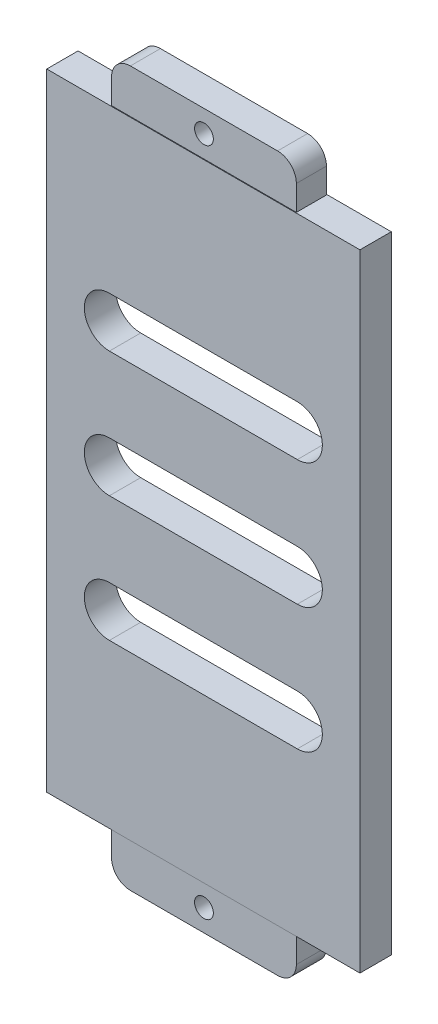
ISO-10303-21;
HEADER;
FILE_DESCRIPTION(('STEP AP214'),'2;1');
FILE_NAME('part.step','',(''),(''),'','','');
FILE_SCHEMA(('AUTOMOTIVE_DESIGN { 1 0 10303 214 1 1 1 1 }'));
ENDSEC;
DATA;
#1=APPLICATION_CONTEXT('core data for automotive mechanical design processes');
#2=APPLICATION_PROTOCOL_DEFINITION('international standard','automotive_design',2000,#1);
#3=PRODUCT_CONTEXT('',#1,'mechanical');
#4=PRODUCT('Part','Part','',(#3));
#5=PRODUCT_RELATED_PRODUCT_CATEGORY('part','',(#4));
#6=PRODUCT_DEFINITION_FORMATION('','',#4);
#7=PRODUCT_DEFINITION_CONTEXT('part definition',#1,'design');
#8=PRODUCT_DEFINITION('design','',#6,#7);
#9=PRODUCT_DEFINITION_SHAPE('','',#8);
#10=(LENGTH_UNIT() NAMED_UNIT(*) SI_UNIT(.MILLI.,.METRE.));
#11=(NAMED_UNIT(*) PLANE_ANGLE_UNIT() SI_UNIT($,.RADIAN.));
#12=(NAMED_UNIT(*) SI_UNIT($,.STERADIAN.) SOLID_ANGLE_UNIT());
#13=UNCERTAINTY_MEASURE_WITH_UNIT(LENGTH_MEASURE(1.E-05),#10,'distance_accuracy_value','');
#14=(GEOMETRIC_REPRESENTATION_CONTEXT(3) GLOBAL_UNCERTAINTY_ASSIGNED_CONTEXT((#13)) GLOBAL_UNIT_ASSIGNED_CONTEXT((#10,
#11,#12)) REPRESENTATION_CONTEXT('',''));
#15=CARTESIAN_POINT('',(0.,0.,0.));
#16=DIRECTION('',(0.,0.,1.));
#17=DIRECTION('',(1.,0.,0.));
#18=AXIS2_PLACEMENT_3D('',#15,#16,#17);
#19=CARTESIAN_POINT('',(-25.,-50.,-5.));
#20=DIRECTION('',(0.,-1.,0.));
#21=DIRECTION('',(0.,0.,-1.));
#22=AXIS2_PLACEMENT_3D('',#19,#20,#21);
#23=PLANE('',#22);
#24=DIRECTION('',(1.,0.,0.));
#25=VECTOR('',#24,1.);
#26=CARTESIAN_POINT('',(-25.,-50.,0.));
#27=LINE('',#26,#25);
#28=CARTESIAN_POINT('',(-25.,-50.,0.));
#29=VERTEX_POINT('',#28);
#30=CARTESIAN_POINT('',(25.,-50.,0.));
#31=VERTEX_POINT('',#30);
#32=EDGE_CURVE('E397',#29,#31,#27,.T.);
#33=ORIENTED_EDGE('',*,*,#32,.F.);
#34=DIRECTION('',(0.,0.,1.));
#35=VECTOR('',#34,1.);
#36=CARTESIAN_POINT('',(-25.,-50.,-5.));
#37=LINE('',#36,#35);
#38=CARTESIAN_POINT('',(-25.,-50.,-5.));
#39=VERTEX_POINT('',#38);
#40=EDGE_CURVE('E420',#39,#29,#37,.T.);
#41=ORIENTED_EDGE('',*,*,#40,.F.);
#42=DIRECTION('',(1.,0.,0.));
#43=VECTOR('',#42,1.);
#44=CARTESIAN_POINT('',(-25.,-50.,-5.));
#45=LINE('',#44,#43);
#46=CARTESIAN_POINT('',(25.,-50.,-5.));
#47=VERTEX_POINT('',#46);
#48=EDGE_CURVE('E403',#39,#47,#45,.T.);
#49=ORIENTED_EDGE('',*,*,#48,.T.);
#50=DIRECTION('',(0.,0.,1.));
#51=VECTOR('',#50,1.);
#52=CARTESIAN_POINT('',(25.,-50.,-5.));
#53=LINE('',#52,#51);
#54=EDGE_CURVE('E417',#47,#31,#53,.T.);
#55=ORIENTED_EDGE('',*,*,#54,.T.);
#56=EDGE_LOOP('',(#33,#41,#49,#55));
#57=FACE_BOUND('',#56,.T.);
#58=DIRECTION('',(1.,0.,0.));
#59=VECTOR('',#58,1.);
#60=CARTESIAN_POINT('',(0.,-50.,-0.100000000000001));
#61=LINE('',#60,#59);
#62=CARTESIAN_POINT('',(-14.75,-50.,-0.100000000000001));
#63=VERTEX_POINT('',#62);
#64=CARTESIAN_POINT('',(14.75,-50.,-0.100000000000001));
#65=VERTEX_POINT('',#64);
#66=EDGE_CURVE('E351',#63,#65,#61,.T.);
#67=ORIENTED_EDGE('',*,*,#66,.T.);
#68=DIRECTION('',(0.,0.,-1.));
#69=VECTOR('',#68,1.);
#70=CARTESIAN_POINT('',(14.75,-50.,0.));
#71=LINE('',#70,#69);
#72=CARTESIAN_POINT('',(14.75,-50.,-4.9));
#73=VERTEX_POINT('',#72);
#74=EDGE_CURVE('E275',#65,#73,#71,.T.);
#75=ORIENTED_EDGE('',*,*,#74,.T.);
#76=DIRECTION('',(1.,0.,0.));
#77=VECTOR('',#76,1.);
#78=CARTESIAN_POINT('',(0.,-50.,-4.9));
#79=LINE('',#78,#77);
#80=CARTESIAN_POINT('',(-14.75,-50.,-4.9));
#81=VERTEX_POINT('',#80);
#82=EDGE_CURVE('E345',#81,#73,#79,.T.);
#83=ORIENTED_EDGE('',*,*,#82,.F.);
#84=DIRECTION('',(0.,0.,-1.));
#85=VECTOR('',#84,1.);
#86=CARTESIAN_POINT('',(-14.75,-50.,0.));
#87=LINE('',#86,#85);
#88=EDGE_CURVE('E354',#63,#81,#87,.T.);
#89=ORIENTED_EDGE('',*,*,#88,.F.);
#90=EDGE_LOOP('',(#67,#75,#83,#89));
#91=FACE_BOUND('',#90,.T.);
#92=ADVANCED_FACE('F43',(#57,#91),#23,.T.);
#93=CARTESIAN_POINT('',(-25.,50.,-5.));
#94=DIRECTION('',(0.,1.,0.));
#95=DIRECTION('',(0.,0.,1.));
#96=AXIS2_PLACEMENT_3D('',#93,#94,#95);
#97=PLANE('',#96);
#98=DIRECTION('',(-1.,0.,0.));
#99=VECTOR('',#98,1.);
#100=CARTESIAN_POINT('',(-25.,50.,0.));
#101=LINE('',#100,#99);
#102=CARTESIAN_POINT('',(25.,50.,0.));
#103=VERTEX_POINT('',#102);
#104=CARTESIAN_POINT('',(-25.,50.,0.));
#105=VERTEX_POINT('',#104);
#106=EDGE_CURVE('E409',#103,#105,#101,.T.);
#107=ORIENTED_EDGE('',*,*,#106,.F.);
#108=DIRECTION('',(0.,0.,1.));
#109=VECTOR('',#108,1.);
#110=CARTESIAN_POINT('',(25.,50.,-5.));
#111=LINE('',#110,#109);
#112=CARTESIAN_POINT('',(25.,50.,-5.));
#113=VERTEX_POINT('',#112);
#114=EDGE_CURVE('E406',#113,#103,#111,.T.);
#115=ORIENTED_EDGE('',*,*,#114,.F.);
#116=DIRECTION('',(-1.,0.,0.));
#117=VECTOR('',#116,1.);
#118=CARTESIAN_POINT('',(-25.,50.,-5.));
#119=LINE('',#118,#117);
#120=CARTESIAN_POINT('',(-25.,50.,-5.));
#121=VERTEX_POINT('',#120);
#122=EDGE_CURVE('E396',#113,#121,#119,.T.);
#123=ORIENTED_EDGE('',*,*,#122,.T.);
#124=DIRECTION('',(0.,0.,1.));
#125=VECTOR('',#124,1.);
#126=CARTESIAN_POINT('',(-25.,50.,-5.));
#127=LINE('',#126,#125);
#128=EDGE_CURVE('E422',#121,#105,#127,.T.);
#129=ORIENTED_EDGE('',*,*,#128,.T.);
#130=EDGE_LOOP('',(#107,#115,#123,#129));
#131=FACE_BOUND('',#130,.T.);
#132=DIRECTION('',(1.,0.,0.));
#133=VECTOR('',#132,1.);
#134=CARTESIAN_POINT('',(0.,50.,-4.9));
#135=LINE('',#134,#133);
#136=CARTESIAN_POINT('',(-14.75,50.,-4.9));
#137=VERTEX_POINT('',#136);
#138=CARTESIAN_POINT('',(14.75,50.,-4.9));
#139=VERTEX_POINT('',#138);
#140=EDGE_CURVE('E377',#137,#139,#135,.T.);
#141=ORIENTED_EDGE('',*,*,#140,.T.);
#142=DIRECTION('',(0.,0.,1.));
#143=VECTOR('',#142,1.);
#144=CARTESIAN_POINT('',(14.75,50.,0.));
#145=LINE('',#144,#143);
#146=CARTESIAN_POINT('',(14.75,50.,-0.100000000000001));
#147=VERTEX_POINT('',#146);
#148=EDGE_CURVE('E366',#139,#147,#145,.T.);
#149=ORIENTED_EDGE('',*,*,#148,.T.);
#150=DIRECTION('',(1.,0.,0.));
#151=VECTOR('',#150,1.);
#152=CARTESIAN_POINT('',(0.,50.,-0.100000000000001));
#153=LINE('',#152,#151);
#154=CARTESIAN_POINT('',(-14.75,50.,-0.100000000000001));
#155=VERTEX_POINT('',#154);
#156=EDGE_CURVE('E371',#155,#147,#153,.T.);
#157=ORIENTED_EDGE('',*,*,#156,.F.);
#158=DIRECTION('',(0.,0.,1.));
#159=VECTOR('',#158,1.);
#160=CARTESIAN_POINT('',(-14.75,50.,0.));
#161=LINE('',#160,#159);
#162=EDGE_CURVE('E380',#137,#155,#161,.T.);
#163=ORIENTED_EDGE('',*,*,#162,.F.);
#164=EDGE_LOOP('',(#141,#149,#157,#163));
#165=FACE_BOUND('',#164,.T.);
#166=ADVANCED_FACE('F487',(#131,#165),#97,.T.);
#167=CARTESIAN_POINT('',(25.,50.,-5.));
#168=DIRECTION('',(1.,0.,0.));
#169=DIRECTION('',(0.,1.,0.));
#170=AXIS2_PLACEMENT_3D('',#167,#168,#169);
#171=PLANE('',#170);
#172=DIRECTION('',(0.,1.,0.));
#173=VECTOR('',#172,1.);
#174=CARTESIAN_POINT('',(25.,50.,0.));
#175=LINE('',#174,#173);
#176=EDGE_CURVE('E392',#31,#103,#175,.T.);
#177=ORIENTED_EDGE('',*,*,#176,.F.);
#178=ORIENTED_EDGE('',*,*,#54,.F.);
#179=DIRECTION('',(0.,1.,0.));
#180=VECTOR('',#179,1.);
#181=CARTESIAN_POINT('',(25.,50.,-5.));
#182=LINE('',#181,#180);
#183=EDGE_CURVE('E393',#47,#113,#182,.T.);
#184=ORIENTED_EDGE('',*,*,#183,.T.);
#185=ORIENTED_EDGE('',*,*,#114,.T.);
#186=EDGE_LOOP('',(#177,#178,#184,#185));
#187=FACE_BOUND('',#186,.T.);
#188=ADVANCED_FACE('F493',(#187),#171,.T.);
#189=CARTESIAN_POINT('',(-25.,50.,-5.));
#190=DIRECTION('',(-1.,0.,0.));
#191=DIRECTION('',(0.,-1.,0.));
#192=AXIS2_PLACEMENT_3D('',#189,#190,#191);
#193=PLANE('',#192);
#194=DIRECTION('',(0.,-1.,0.));
#195=VECTOR('',#194,1.);
#196=CARTESIAN_POINT('',(-25.,50.,0.));
#197=LINE('',#196,#195);
#198=EDGE_CURVE('E412',#105,#29,#197,.T.);
#199=ORIENTED_EDGE('',*,*,#198,.F.);
#200=ORIENTED_EDGE('',*,*,#128,.F.);
#201=DIRECTION('',(0.,-1.,0.));
#202=VECTOR('',#201,1.);
#203=CARTESIAN_POINT('',(-25.,50.,-5.));
#204=LINE('',#203,#202);
#205=EDGE_CURVE('E400',#121,#39,#204,.T.);
#206=ORIENTED_EDGE('',*,*,#205,.T.);
#207=ORIENTED_EDGE('',*,*,#40,.T.);
#208=EDGE_LOOP('',(#199,#200,#206,#207));
#209=FACE_BOUND('',#208,.T.);
#210=ADVANCED_FACE('F501',(#209),#193,.T.);
#211=CARTESIAN_POINT('',(0.,0.,-5.));
#212=DIRECTION('',(0.,0.,1.));
#213=DIRECTION('',(1.,0.,0.));
#214=AXIS2_PLACEMENT_3D('',#211,#212,#213);
#215=PLANE('',#214);
#216=CARTESIAN_POINT('',(-15.,20.,-5.));
#217=DIRECTION('',(0.,0.,1.));
#218=DIRECTION('',(1.,0.,0.));
#219=AXIS2_PLACEMENT_3D('',#216,#217,#218);
#220=CIRCLE('',#219,4.);
#221=CARTESIAN_POINT('',(-15.,24.,-5.));
#222=VERTEX_POINT('',#221);
#223=CARTESIAN_POINT('',(-15.,16.,-5.));
#224=VERTEX_POINT('',#223);
#225=EDGE_CURVE('E243',#222,#224,#220,.T.);
#226=ORIENTED_EDGE('',*,*,#225,.T.);
#227=DIRECTION('',(1.,0.,0.));
#228=VECTOR('',#227,1.);
#229=CARTESIAN_POINT('',(0.,16.,-5.));
#230=LINE('',#229,#228);
#231=CARTESIAN_POINT('',(15.,16.,-5.));
#232=VERTEX_POINT('',#231);
#233=EDGE_CURVE('E235',#224,#232,#230,.T.);
#234=ORIENTED_EDGE('',*,*,#233,.T.);
#235=CARTESIAN_POINT('',(15.,20.,-5.));
#236=DIRECTION('',(0.,0.,1.));
#237=DIRECTION('',(1.,0.,0.));
#238=AXIS2_PLACEMENT_3D('',#235,#236,#237);
#239=CIRCLE('',#238,4.);
#240=CARTESIAN_POINT('',(15.,24.,-5.));
#241=VERTEX_POINT('',#240);
#242=EDGE_CURVE('E246',#232,#241,#239,.T.);
#243=ORIENTED_EDGE('',*,*,#242,.T.);
#244=DIRECTION('',(1.,0.,0.));
#245=VECTOR('',#244,1.);
#246=CARTESIAN_POINT('',(0.,24.,-5.));
#247=LINE('',#246,#245);
#248=EDGE_CURVE('E251',#222,#241,#247,.T.);
#249=ORIENTED_EDGE('',*,*,#248,.F.);
#250=EDGE_LOOP('',(#226,#234,#243,#249));
#251=FACE_BOUND('',#250,.T.);
#252=CARTESIAN_POINT('',(-15.,0.,-5.));
#253=DIRECTION('',(0.,0.,1.));
#254=DIRECTION('',(1.,0.,0.));
#255=AXIS2_PLACEMENT_3D('',#252,#253,#254);
#256=CIRCLE('',#255,4.);
#257=CARTESIAN_POINT('',(-15.,4.,-5.));
#258=VERTEX_POINT('',#257);
#259=CARTESIAN_POINT('',(-15.,-4.,-5.));
#260=VERTEX_POINT('',#259);
#261=EDGE_CURVE('E289',#258,#260,#256,.T.);
#262=ORIENTED_EDGE('',*,*,#261,.T.);
#263=DIRECTION('',(1.,0.,0.));
#264=VECTOR('',#263,1.);
#265=CARTESIAN_POINT('',(0.,-3.99999999999999,-5.));
#266=LINE('',#265,#264);
#267=CARTESIAN_POINT('',(15.,-3.99999999999999,-5.));
#268=VERTEX_POINT('',#267);
#269=EDGE_CURVE('E279',#260,#268,#266,.T.);
#270=ORIENTED_EDGE('',*,*,#269,.T.);
#271=CARTESIAN_POINT('',(15.,0.,-5.));
#272=DIRECTION('',(0.,0.,1.));
#273=DIRECTION('',(1.,0.,0.));
#274=AXIS2_PLACEMENT_3D('',#271,#272,#273);
#275=CIRCLE('',#274,4.);
#276=CARTESIAN_POINT('',(15.,4.,-5.));
#277=VERTEX_POINT('',#276);
#278=EDGE_CURVE('E282',#268,#277,#275,.T.);
#279=ORIENTED_EDGE('',*,*,#278,.T.);
#280=DIRECTION('',(1.,0.,0.));
#281=VECTOR('',#280,1.);
#282=CARTESIAN_POINT('',(0.,4.,-5.));
#283=LINE('',#282,#281);
#284=EDGE_CURVE('E286',#258,#277,#283,.T.);
#285=ORIENTED_EDGE('',*,*,#284,.F.);
#286=EDGE_LOOP('',(#262,#270,#279,#285));
#287=FACE_BOUND('',#286,.T.);
#288=CARTESIAN_POINT('',(-15.,-20.,-5.));
#289=DIRECTION('',(0.,0.,1.));
#290=DIRECTION('',(1.,0.,0.));
#291=AXIS2_PLACEMENT_3D('',#288,#289,#290);
#292=CIRCLE('',#291,4.);
#293=CARTESIAN_POINT('',(-15.,-16.,-5.));
#294=VERTEX_POINT('',#293);
#295=CARTESIAN_POINT('',(-15.,-24.,-5.));
#296=VERTEX_POINT('',#295);
#297=EDGE_CURVE('E321',#294,#296,#292,.T.);
#298=ORIENTED_EDGE('',*,*,#297,.T.);
#299=DIRECTION('',(1.,0.,0.));
#300=VECTOR('',#299,1.);
#301=CARTESIAN_POINT('',(0.,-24.,-5.));
#302=LINE('',#301,#300);
#303=CARTESIAN_POINT('',(15.,-24.,-5.));
#304=VERTEX_POINT('',#303);
#305=EDGE_CURVE('E311',#296,#304,#302,.T.);
#306=ORIENTED_EDGE('',*,*,#305,.T.);
#307=CARTESIAN_POINT('',(15.,-20.,-5.));
#308=DIRECTION('',(0.,0.,1.));
#309=DIRECTION('',(1.,0.,0.));
#310=AXIS2_PLACEMENT_3D('',#307,#308,#309);
#311=CIRCLE('',#310,4.);
#312=CARTESIAN_POINT('',(15.,-16.,-5.));
#313=VERTEX_POINT('',#312);
#314=EDGE_CURVE('E314',#304,#313,#311,.T.);
#315=ORIENTED_EDGE('',*,*,#314,.T.);
#316=DIRECTION('',(1.,0.,0.));
#317=VECTOR('',#316,1.);
#318=CARTESIAN_POINT('',(0.,-16.,-5.));
#319=LINE('',#318,#317);
#320=EDGE_CURVE('E318',#294,#313,#319,.T.);
#321=ORIENTED_EDGE('',*,*,#320,.F.);
#322=EDGE_LOOP('',(#298,#306,#315,#321));
#323=FACE_BOUND('',#322,.T.);
#324=ORIENTED_EDGE('',*,*,#183,.F.);
#325=ORIENTED_EDGE('',*,*,#48,.F.);
#326=ORIENTED_EDGE('',*,*,#205,.F.);
#327=ORIENTED_EDGE('',*,*,#122,.F.);
#328=EDGE_LOOP('',(#324,#325,#326,#327));
#329=FACE_BOUND('',#328,.T.);
#330=ADVANCED_FACE('F253',(#251,#287,#323,#329),#215,.F.);
#331=CARTESIAN_POINT('',(0.,0.,0.));
#332=DIRECTION('',(0.,0.,1.));
#333=DIRECTION('',(1.,0.,0.));
#334=AXIS2_PLACEMENT_3D('',#331,#332,#333);
#335=PLANE('',#334);
#336=DIRECTION('',(1.,0.,0.));
#337=VECTOR('',#336,1.);
#338=CARTESIAN_POINT('',(0.,16.,0.));
#339=LINE('',#338,#337);
#340=CARTESIAN_POINT('',(-15.,16.,0.));
#341=VERTEX_POINT('',#340);
#342=CARTESIAN_POINT('',(15.,16.,0.));
#343=VERTEX_POINT('',#342);
#344=EDGE_CURVE('E238',#341,#343,#339,.T.);
#345=ORIENTED_EDGE('',*,*,#344,.F.);
#346=CARTESIAN_POINT('',(-15.,20.,0.));
#347=DIRECTION('',(0.,0.,1.));
#348=DIRECTION('',(1.,0.,0.));
#349=AXIS2_PLACEMENT_3D('',#346,#347,#348);
#350=CIRCLE('',#349,4.);
#351=CARTESIAN_POINT('',(-15.,24.,0.));
#352=VERTEX_POINT('',#351);
#353=EDGE_CURVE('E256',#352,#341,#350,.T.);
#354=ORIENTED_EDGE('',*,*,#353,.F.);
#355=DIRECTION('',(1.,0.,0.));
#356=VECTOR('',#355,1.);
#357=CARTESIAN_POINT('',(0.,24.,0.));
#358=LINE('',#357,#356);
#359=CARTESIAN_POINT('',(15.,24.,0.));
#360=VERTEX_POINT('',#359);
#361=EDGE_CURVE('E259',#352,#360,#358,.T.);
#362=ORIENTED_EDGE('',*,*,#361,.T.);
#363=CARTESIAN_POINT('',(15.,20.,0.));
#364=DIRECTION('',(0.,0.,1.));
#365=DIRECTION('',(1.,0.,0.));
#366=AXIS2_PLACEMENT_3D('',#363,#364,#365);
#367=CIRCLE('',#366,4.);
#368=EDGE_CURVE('E268',#343,#360,#367,.T.);
#369=ORIENTED_EDGE('',*,*,#368,.F.);
#370=EDGE_LOOP('',(#345,#354,#362,#369));
#371=FACE_BOUND('',#370,.T.);
#372=DIRECTION('',(1.,0.,0.));
#373=VECTOR('',#372,1.);
#374=CARTESIAN_POINT('',(0.,-3.99999999999999,0.));
#375=LINE('',#374,#373);
#376=CARTESIAN_POINT('',(-15.,-4.,0.));
#377=VERTEX_POINT('',#376);
#378=CARTESIAN_POINT('',(15.,-4.,0.));
#379=VERTEX_POINT('',#378);
#380=EDGE_CURVE('E293',#377,#379,#375,.T.);
#381=ORIENTED_EDGE('',*,*,#380,.F.);
#382=CARTESIAN_POINT('',(-15.,0.,0.));
#383=DIRECTION('',(0.,0.,1.));
#384=DIRECTION('',(1.,0.,0.));
#385=AXIS2_PLACEMENT_3D('',#382,#383,#384);
#386=CIRCLE('',#385,4.);
#387=CARTESIAN_POINT('',(-15.,4.,0.));
#388=VERTEX_POINT('',#387);
#389=EDGE_CURVE('E283',#388,#377,#386,.T.);
#390=ORIENTED_EDGE('',*,*,#389,.F.);
#391=DIRECTION('',(1.,0.,0.));
#392=VECTOR('',#391,1.);
#393=CARTESIAN_POINT('',(0.,4.,0.));
#394=LINE('',#393,#392);
#395=CARTESIAN_POINT('',(15.,4.,0.));
#396=VERTEX_POINT('',#395);
#397=EDGE_CURVE('E299',#388,#396,#394,.T.);
#398=ORIENTED_EDGE('',*,*,#397,.T.);
#399=CARTESIAN_POINT('',(15.,0.,0.));
#400=DIRECTION('',(0.,0.,1.));
#401=DIRECTION('',(1.,0.,0.));
#402=AXIS2_PLACEMENT_3D('',#399,#400,#401);
#403=CIRCLE('',#402,4.);
#404=EDGE_CURVE('E295',#379,#396,#403,.T.);
#405=ORIENTED_EDGE('',*,*,#404,.F.);
#406=EDGE_LOOP('',(#381,#390,#398,#405));
#407=FACE_BOUND('',#406,.T.);
#408=DIRECTION('',(1.,0.,0.));
#409=VECTOR('',#408,1.);
#410=CARTESIAN_POINT('',(0.,-24.,0.));
#411=LINE('',#410,#409);
#412=CARTESIAN_POINT('',(-15.,-24.,0.));
#413=VERTEX_POINT('',#412);
#414=CARTESIAN_POINT('',(15.,-24.,0.));
#415=VERTEX_POINT('',#414);
#416=EDGE_CURVE('E325',#413,#415,#411,.T.);
#417=ORIENTED_EDGE('',*,*,#416,.F.);
#418=CARTESIAN_POINT('',(-15.,-20.,0.));
#419=DIRECTION('',(0.,0.,1.));
#420=DIRECTION('',(1.,0.,0.));
#421=AXIS2_PLACEMENT_3D('',#418,#419,#420);
#422=CIRCLE('',#421,4.);
#423=CARTESIAN_POINT('',(-15.,-16.,0.));
#424=VERTEX_POINT('',#423);
#425=EDGE_CURVE('E315',#424,#413,#422,.T.);
#426=ORIENTED_EDGE('',*,*,#425,.F.);
#427=DIRECTION('',(1.,0.,0.));
#428=VECTOR('',#427,1.);
#429=CARTESIAN_POINT('',(0.,-16.,0.));
#430=LINE('',#429,#428);
#431=CARTESIAN_POINT('',(15.,-16.,0.));
#432=VERTEX_POINT('',#431);
#433=EDGE_CURVE('E330',#424,#432,#430,.T.);
#434=ORIENTED_EDGE('',*,*,#433,.T.);
#435=CARTESIAN_POINT('',(15.,-20.,0.));
#436=DIRECTION('',(0.,0.,1.));
#437=DIRECTION('',(1.,0.,0.));
#438=AXIS2_PLACEMENT_3D('',#435,#436,#437);
#439=CIRCLE('',#438,4.);
#440=EDGE_CURVE('E327',#415,#432,#439,.T.);
#441=ORIENTED_EDGE('',*,*,#440,.F.);
#442=EDGE_LOOP('',(#417,#426,#434,#441));
#443=FACE_BOUND('',#442,.T.);
#444=ORIENTED_EDGE('',*,*,#176,.T.);
#445=ORIENTED_EDGE('',*,*,#106,.T.);
#446=ORIENTED_EDGE('',*,*,#198,.T.);
#447=ORIENTED_EDGE('',*,*,#32,.T.);
#448=EDGE_LOOP('',(#444,#445,#446,#447));
#449=FACE_BOUND('',#448,.T.);
#450=ADVANCED_FACE('F499',(#371,#407,#443,#449),#335,.T.);
#451=CARTESIAN_POINT('',(14.75,57.,0.));
#452=DIRECTION('',(1.,0.,0.));
#453=DIRECTION('',(0.,0.,-1.));
#454=AXIS2_PLACEMENT_3D('',#451,#452,#453);
#455=PLANE('',#454);
#456=DIRECTION('',(0.,-1.,0.));
#457=VECTOR('',#456,1.);
#458=CARTESIAN_POINT('',(14.75,57.,-4.9));
#459=LINE('',#458,#457);
#460=CARTESIAN_POINT('',(14.75,54.,-4.9));
#461=VERTEX_POINT('',#460);
#462=EDGE_CURVE('E390',#461,#139,#459,.T.);
#463=ORIENTED_EDGE('',*,*,#462,.F.);
#464=DIRECTION('',(0.,0.,1.));
#465=VECTOR('',#464,1.);
#466=CARTESIAN_POINT('',(14.75,54.,0.));
#467=LINE('',#466,#465);
#468=CARTESIAN_POINT('',(14.75,54.,-0.100000000000001));
#469=VERTEX_POINT('',#468);
#470=EDGE_CURVE('E419',#461,#469,#467,.T.);
#471=ORIENTED_EDGE('',*,*,#470,.T.);
#472=DIRECTION('',(0.,-1.,0.));
#473=VECTOR('',#472,1.);
#474=CARTESIAN_POINT('',(14.75,57.,-0.100000000000001));
#475=LINE('',#474,#473);
#476=EDGE_CURVE('E374',#469,#147,#475,.T.);
#477=ORIENTED_EDGE('',*,*,#476,.T.);
#478=ORIENTED_EDGE('',*,*,#148,.F.);
#479=EDGE_LOOP('',(#463,#471,#477,#478));
#480=FACE_BOUND('',#479,.T.);
#481=ADVANCED_FACE('F533',(#480),#455,.T.);
#482=CARTESIAN_POINT('',(0.,57.,-4.9));
#483=DIRECTION('',(0.,0.,-1.));
#484=DIRECTION('',(-1.,0.,0.));
#485=AXIS2_PLACEMENT_3D('',#482,#483,#484);
#486=PLANE('',#485);
#487=CARTESIAN_POINT('',(0.,53.5,-4.9));
#488=DIRECTION('',(0.,0.,-1.));
#489=DIRECTION('',(-1.,0.,0.));
#490=AXIS2_PLACEMENT_3D('',#487,#488,#489);
#491=CIRCLE('',#490,1.5);
#492=CARTESIAN_POINT('',(-1.50000000000001,53.5,-4.9));
#493=VERTEX_POINT('',#492);
#494=EDGE_CURVE('E262',#493,#493,#491,.T.);
#495=ORIENTED_EDGE('',*,*,#494,.F.);
#496=EDGE_LOOP('',(#495));
#497=FACE_BOUND('',#496,.T.);
#498=DIRECTION('',(1.,0.,0.));
#499=VECTOR('',#498,1.);
#500=CARTESIAN_POINT('',(0.,57.,-4.9));
#501=LINE('',#500,#499);
#502=CARTESIAN_POINT('',(-11.75,57.,-4.9));
#503=VERTEX_POINT('',#502);
#504=CARTESIAN_POINT('',(11.75,57.,-4.9));
#505=VERTEX_POINT('',#504);
#506=EDGE_CURVE('E367',#503,#505,#501,.T.);
#507=ORIENTED_EDGE('',*,*,#506,.T.);
#508=CARTESIAN_POINT('',(11.75,54.,-4.9));
#509=DIRECTION('',(0.,0.,-1.));
#510=DIRECTION('',(-1.,0.,0.));
#511=AXIS2_PLACEMENT_3D('',#508,#509,#510);
#512=CIRCLE('',#511,3.);
#513=EDGE_CURVE('E438',#505,#461,#512,.T.);
#514=ORIENTED_EDGE('',*,*,#513,.T.);
#515=ORIENTED_EDGE('',*,*,#462,.T.);
#516=ORIENTED_EDGE('',*,*,#140,.F.);
#517=DIRECTION('',(0.,-1.,0.));
#518=VECTOR('',#517,1.);
#519=CARTESIAN_POINT('',(-14.75,57.,-4.9));
#520=LINE('',#519,#518);
#521=CARTESIAN_POINT('',(-14.75,54.,-4.9));
#522=VERTEX_POINT('',#521);
#523=EDGE_CURVE('E388',#522,#137,#520,.T.);
#524=ORIENTED_EDGE('',*,*,#523,.F.);
#525=CARTESIAN_POINT('',(-11.75,54.,-4.9));
#526=DIRECTION('',(0.,0.,-1.));
#527=DIRECTION('',(-1.,0.,0.));
#528=AXIS2_PLACEMENT_3D('',#525,#526,#527);
#529=CIRCLE('',#528,3.);
#530=EDGE_CURVE('E436',#522,#503,#529,.T.);
#531=ORIENTED_EDGE('',*,*,#530,.T.);
#532=EDGE_LOOP('',(#507,#514,#515,#516,#524,#531));
#533=FACE_BOUND('',#532,.T.);
#534=ADVANCED_FACE('F522',(#497,#533),#486,.T.);
#535=CARTESIAN_POINT('',(-14.75,57.,0.));
#536=DIRECTION('',(1.,0.,0.));
#537=DIRECTION('',(0.,0.,-1.));
#538=AXIS2_PLACEMENT_3D('',#535,#536,#537);
#539=PLANE('',#538);
#540=DIRECTION('',(0.,-1.,0.));
#541=VECTOR('',#540,1.);
#542=CARTESIAN_POINT('',(-14.75,57.,-0.100000000000001));
#543=LINE('',#542,#541);
#544=CARTESIAN_POINT('',(-14.75,54.,-0.100000000000001));
#545=VERTEX_POINT('',#544);
#546=EDGE_CURVE('E386',#545,#155,#543,.T.);
#547=ORIENTED_EDGE('',*,*,#546,.F.);
#548=DIRECTION('',(0.,0.,1.));
#549=VECTOR('',#548,1.);
#550=CARTESIAN_POINT('',(-14.75,54.,-4.9));
#551=LINE('',#550,#549);
#552=EDGE_CURVE('E440',#545,#522,#551,.F.);
#553=ORIENTED_EDGE('',*,*,#552,.T.);
#554=ORIENTED_EDGE('',*,*,#523,.T.);
#555=ORIENTED_EDGE('',*,*,#162,.T.);
#556=EDGE_LOOP('',(#547,#553,#554,#555));
#557=FACE_BOUND('',#556,.T.);
#558=ADVANCED_FACE('F540',(#557),#539,.F.);
#559=CARTESIAN_POINT('',(0.,57.,-0.100000000000001));
#560=DIRECTION('',(0.,0.,-1.));
#561=DIRECTION('',(-1.,0.,0.));
#562=AXIS2_PLACEMENT_3D('',#559,#560,#561);
#563=PLANE('',#562);
#564=CARTESIAN_POINT('',(0.,53.5,-0.100000000000001));
#565=DIRECTION('',(0.,0.,1.));
#566=DIRECTION('',(1.,0.,0.));
#567=AXIS2_PLACEMENT_3D('',#564,#565,#566);
#568=CIRCLE('',#567,1.5);
#569=CARTESIAN_POINT('',(1.5,53.5,-0.100000000000001));
#570=VERTEX_POINT('',#569);
#571=EDGE_CURVE('E922',#570,#570,#568,.T.);
#572=ORIENTED_EDGE('',*,*,#571,.F.);
#573=EDGE_LOOP('',(#572));
#574=FACE_BOUND('',#573,.T.);
#575=ORIENTED_EDGE('',*,*,#476,.F.);
#576=CARTESIAN_POINT('',(11.75,54.,-0.100000000000001));
#577=DIRECTION('',(0.,0.,-1.));
#578=DIRECTION('',(-1.,0.,0.));
#579=AXIS2_PLACEMENT_3D('',#576,#577,#578);
#580=CIRCLE('',#579,3.);
#581=CARTESIAN_POINT('',(11.75,57.,-0.100000000000001));
#582=VERTEX_POINT('',#581);
#583=EDGE_CURVE('E429',#469,#582,#580,.F.);
#584=ORIENTED_EDGE('',*,*,#583,.T.);
#585=DIRECTION('',(1.,0.,0.));
#586=VECTOR('',#585,1.);
#587=CARTESIAN_POINT('',(0.,57.,-0.100000000000001));
#588=LINE('',#587,#586);
#589=CARTESIAN_POINT('',(-11.75,57.,-0.100000000000001));
#590=VERTEX_POINT('',#589);
#591=EDGE_CURVE('E370',#590,#582,#588,.T.);
#592=ORIENTED_EDGE('',*,*,#591,.F.);
#593=CARTESIAN_POINT('',(-11.75,54.,-0.100000000000001));
#594=DIRECTION('',(0.,0.,-1.));
#595=DIRECTION('',(-1.,0.,0.));
#596=AXIS2_PLACEMENT_3D('',#593,#594,#595);
#597=CIRCLE('',#596,3.);
#598=EDGE_CURVE('E427',#590,#545,#597,.F.);
#599=ORIENTED_EDGE('',*,*,#598,.T.);
#600=ORIENTED_EDGE('',*,*,#546,.T.);
#601=ORIENTED_EDGE('',*,*,#156,.T.);
#602=EDGE_LOOP('',(#575,#584,#592,#599,#600,#601));
#603=FACE_BOUND('',#602,.T.);
#604=ADVANCED_FACE('F542',(#574,#603),#563,.F.);
#605=CARTESIAN_POINT('',(0.,57.,0.));
#606=DIRECTION('',(0.,1.,0.));
#607=DIRECTION('',(0.,0.,1.));
#608=AXIS2_PLACEMENT_3D('',#605,#606,#607);
#609=PLANE('',#608);
#610=ORIENTED_EDGE('',*,*,#591,.T.);
#611=DIRECTION('',(0.,0.,1.));
#612=VECTOR('',#611,1.);
#613=CARTESIAN_POINT('',(11.75,57.,0.));
#614=LINE('',#613,#612);
#615=EDGE_CURVE('E434',#582,#505,#614,.F.);
#616=ORIENTED_EDGE('',*,*,#615,.T.);
#617=ORIENTED_EDGE('',*,*,#506,.F.);
#618=DIRECTION('',(0.,0.,1.));
#619=VECTOR('',#618,1.);
#620=CARTESIAN_POINT('',(-11.75,57.,-0.100000000000001));
#621=LINE('',#620,#619);
#622=EDGE_CURVE('E431',#503,#590,#621,.T.);
#623=ORIENTED_EDGE('',*,*,#622,.T.);
#624=EDGE_LOOP('',(#610,#616,#617,#623));
#625=FACE_BOUND('',#624,.T.);
#626=ADVANCED_FACE('F526',(#625),#609,.T.);
#627=CARTESIAN_POINT('',(14.75,-57.,0.));
#628=DIRECTION('',(1.,0.,0.));
#629=DIRECTION('',(0.,0.,-1.));
#630=AXIS2_PLACEMENT_3D('',#627,#628,#629);
#631=PLANE('',#630);
#632=DIRECTION('',(0.,1.,0.));
#633=VECTOR('',#632,1.);
#634=CARTESIAN_POINT('',(14.75,-57.,-0.100000000000001));
#635=LINE('',#634,#633);
#636=CARTESIAN_POINT('',(14.75,-54.,-0.100000000000001));
#637=VERTEX_POINT('',#636);
#638=EDGE_CURVE('E364',#637,#65,#635,.T.);
#639=ORIENTED_EDGE('',*,*,#638,.F.);
#640=DIRECTION('',(0.,0.,-1.));
#641=VECTOR('',#640,1.);
#642=CARTESIAN_POINT('',(14.75,-54.,0.));
#643=LINE('',#642,#641);
#644=CARTESIAN_POINT('',(14.75,-54.,-4.9));
#645=VERTEX_POINT('',#644);
#646=EDGE_CURVE('E11',#637,#645,#643,.T.);
#647=ORIENTED_EDGE('',*,*,#646,.T.);
#648=DIRECTION('',(0.,1.,0.));
#649=VECTOR('',#648,1.);
#650=CARTESIAN_POINT('',(14.75,-57.,-4.9));
#651=LINE('',#650,#649);
#652=EDGE_CURVE('E348',#645,#73,#651,.T.);
#653=ORIENTED_EDGE('',*,*,#652,.T.);
#654=ORIENTED_EDGE('',*,*,#74,.F.);
#655=EDGE_LOOP('',(#639,#647,#653,#654));
#656=FACE_BOUND('',#655,.T.);
#657=ADVANCED_FACE('F473',(#656),#631,.T.);
#658=CARTESIAN_POINT('',(0.,-57.,-0.100000000000001));
#659=DIRECTION('',(0.,0.,1.));
#660=DIRECTION('',(1.,0.,0.));
#661=AXIS2_PLACEMENT_3D('',#658,#659,#660);
#662=PLANE('',#661);
#663=CARTESIAN_POINT('',(0.,-53.5,-0.100000000000001));
#664=DIRECTION('',(0.,0.,1.));
#665=DIRECTION('',(1.,0.,0.));
#666=AXIS2_PLACEMENT_3D('',#663,#664,#665);
#667=CIRCLE('',#666,1.5);
#668=CARTESIAN_POINT('',(1.50000000000001,-53.5,-0.100000000000001));
#669=VERTEX_POINT('',#668);
#670=EDGE_CURVE('E919',#669,#669,#667,.T.);
#671=ORIENTED_EDGE('',*,*,#670,.F.);
#672=EDGE_LOOP('',(#671));
#673=FACE_BOUND('',#672,.T.);
#674=DIRECTION('',(0.,1.,0.));
#675=VECTOR('',#674,1.);
#676=CARTESIAN_POINT('',(-14.75,-57.,-0.100000000000001));
#677=LINE('',#676,#675);
#678=CARTESIAN_POINT('',(-14.75,-54.,-0.100000000000001));
#679=VERTEX_POINT('',#678);
#680=EDGE_CURVE('E362',#679,#63,#677,.T.);
#681=ORIENTED_EDGE('',*,*,#680,.F.);
#682=CARTESIAN_POINT('',(-11.75,-54.,-0.100000000000001));
#683=DIRECTION('',(0.,0.,1.));
#684=DIRECTION('',(1.,0.,0.));
#685=AXIS2_PLACEMENT_3D('',#682,#683,#684);
#686=CIRCLE('',#685,3.);
#687=CARTESIAN_POINT('',(-11.75,-57.,-0.100000000000001));
#688=VERTEX_POINT('',#687);
#689=EDGE_CURVE('E52',#679,#688,#686,.T.);
#690=ORIENTED_EDGE('',*,*,#689,.T.);
#691=DIRECTION('',(1.,0.,0.));
#692=VECTOR('',#691,1.);
#693=CARTESIAN_POINT('',(0.,-57.,-0.100000000000001));
#694=LINE('',#693,#692);
#695=CARTESIAN_POINT('',(11.75,-57.,-0.100000000000001));
#696=VERTEX_POINT('',#695);
#697=EDGE_CURVE('E342',#688,#696,#694,.T.);
#698=ORIENTED_EDGE('',*,*,#697,.T.);
#699=CARTESIAN_POINT('',(11.75,-54.,-0.100000000000001));
#700=DIRECTION('',(0.,0.,1.));
#701=DIRECTION('',(1.,0.,0.));
#702=AXIS2_PLACEMENT_3D('',#699,#700,#701);
#703=CIRCLE('',#702,3.);
#704=EDGE_CURVE('E59',#696,#637,#703,.T.);
#705=ORIENTED_EDGE('',*,*,#704,.T.);
#706=ORIENTED_EDGE('',*,*,#638,.T.);
#707=ORIENTED_EDGE('',*,*,#66,.F.);
#708=EDGE_LOOP('',(#681,#690,#698,#705,#706,#707));
#709=FACE_BOUND('',#708,.T.);
#710=ADVANCED_FACE('F455',(#673,#709),#662,.T.);
#711=CARTESIAN_POINT('',(-14.75,-57.,0.));
#712=DIRECTION('',(1.,0.,0.));
#713=DIRECTION('',(0.,0.,-1.));
#714=AXIS2_PLACEMENT_3D('',#711,#712,#713);
#715=PLANE('',#714);
#716=DIRECTION('',(0.,1.,0.));
#717=VECTOR('',#716,1.);
#718=CARTESIAN_POINT('',(-14.75,-57.,-4.9));
#719=LINE('',#718,#717);
#720=CARTESIAN_POINT('',(-14.75,-54.,-4.9));
#721=VERTEX_POINT('',#720);
#722=EDGE_CURVE('E360',#721,#81,#719,.T.);
#723=ORIENTED_EDGE('',*,*,#722,.F.);
#724=DIRECTION('',(0.,0.,-1.));
#725=VECTOR('',#724,1.);
#726=CARTESIAN_POINT('',(-14.75,-54.,-0.100000000000001));
#727=LINE('',#726,#725);
#728=EDGE_CURVE('E67',#721,#679,#727,.F.);
#729=ORIENTED_EDGE('',*,*,#728,.T.);
#730=ORIENTED_EDGE('',*,*,#680,.T.);
#731=ORIENTED_EDGE('',*,*,#88,.T.);
#732=EDGE_LOOP('',(#723,#729,#730,#731));
#733=FACE_BOUND('',#732,.T.);
#734=ADVANCED_FACE('F466',(#733),#715,.F.);
#735=CARTESIAN_POINT('',(0.,-57.,-4.9));
#736=DIRECTION('',(0.,0.,1.));
#737=DIRECTION('',(1.,0.,0.));
#738=AXIS2_PLACEMENT_3D('',#735,#736,#737);
#739=PLANE('',#738);
#740=CARTESIAN_POINT('',(0.,-53.5,-4.9));
#741=DIRECTION('',(0.,0.,1.));
#742=DIRECTION('',(1.,0.,0.));
#743=AXIS2_PLACEMENT_3D('',#740,#741,#742);
#744=CIRCLE('',#743,1.5);
#745=CARTESIAN_POINT('',(1.50000000000001,-53.5,-4.9));
#746=VERTEX_POINT('',#745);
#747=EDGE_CURVE('E47',#746,#746,#744,.T.);
#748=ORIENTED_EDGE('',*,*,#747,.T.);
#749=EDGE_LOOP('',(#748));
#750=FACE_BOUND('',#749,.T.);
#751=DIRECTION('',(1.,0.,0.));
#752=VECTOR('',#751,1.);
#753=CARTESIAN_POINT('',(0.,-57.,-4.9));
#754=LINE('',#753,#752);
#755=CARTESIAN_POINT('',(-11.75,-57.,-4.9));
#756=VERTEX_POINT('',#755);
#757=CARTESIAN_POINT('',(11.75,-57.,-4.9));
#758=VERTEX_POINT('',#757);
#759=EDGE_CURVE('E344',#756,#758,#754,.T.);
#760=ORIENTED_EDGE('',*,*,#759,.F.);
#761=CARTESIAN_POINT('',(-11.75,-54.,-4.9));
#762=DIRECTION('',(0.,0.,1.));
#763=DIRECTION('',(1.,0.,0.));
#764=AXIS2_PLACEMENT_3D('',#761,#762,#763);
#765=CIRCLE('',#764,3.);
#766=EDGE_CURVE('E449',#756,#721,#765,.F.);
#767=ORIENTED_EDGE('',*,*,#766,.T.);
#768=ORIENTED_EDGE('',*,*,#722,.T.);
#769=ORIENTED_EDGE('',*,*,#82,.T.);
#770=ORIENTED_EDGE('',*,*,#652,.F.);
#771=CARTESIAN_POINT('',(11.75,-54.,-4.9));
#772=DIRECTION('',(0.,0.,1.));
#773=DIRECTION('',(1.,0.,0.));
#774=AXIS2_PLACEMENT_3D('',#771,#772,#773);
#775=CIRCLE('',#774,3.);
#776=EDGE_CURVE('E447',#645,#758,#775,.F.);
#777=ORIENTED_EDGE('',*,*,#776,.T.);
#778=EDGE_LOOP('',(#760,#767,#768,#769,#770,#777));
#779=FACE_BOUND('',#778,.T.);
#780=ADVANCED_FACE('F465',(#750,#779),#739,.F.);
#781=CARTESIAN_POINT('',(0.,-57.,0.));
#782=DIRECTION('',(0.,-1.,0.));
#783=DIRECTION('',(0.,0.,-1.));
#784=AXIS2_PLACEMENT_3D('',#781,#782,#783);
#785=PLANE('',#784);
#786=ORIENTED_EDGE('',*,*,#697,.F.);
#787=DIRECTION('',(0.,0.,-1.));
#788=VECTOR('',#787,1.);
#789=CARTESIAN_POINT('',(-11.75,-57.,-4.9));
#790=LINE('',#789,#788);
#791=EDGE_CURVE('E444',#688,#756,#790,.T.);
#792=ORIENTED_EDGE('',*,*,#791,.T.);
#793=ORIENTED_EDGE('',*,*,#759,.T.);
#794=DIRECTION('',(0.,0.,-1.));
#795=VECTOR('',#794,1.);
#796=CARTESIAN_POINT('',(11.75,-57.,0.));
#797=LINE('',#796,#795);
#798=EDGE_CURVE('E442',#758,#696,#797,.F.);
#799=ORIENTED_EDGE('',*,*,#798,.T.);
#800=EDGE_LOOP('',(#786,#792,#793,#799));
#801=FACE_BOUND('',#800,.T.);
#802=ADVANCED_FACE('F460',(#801),#785,.T.);
#803=CARTESIAN_POINT('',(0.,-24.,-5.));
#804=DIRECTION('',(0.,-1.,0.));
#805=DIRECTION('',(1.,0.,0.));
#806=AXIS2_PLACEMENT_3D('',#803,#804,#805);
#807=PLANE('',#806);
#808=ORIENTED_EDGE('',*,*,#416,.T.);
#809=DIRECTION('',(0.,0.,1.));
#810=VECTOR('',#809,1.);
#811=CARTESIAN_POINT('',(15.,-24.,-5.));
#812=LINE('',#811,#810);
#813=EDGE_CURVE('E324',#304,#415,#812,.T.);
#814=ORIENTED_EDGE('',*,*,#813,.F.);
#815=ORIENTED_EDGE('',*,*,#305,.F.);
#816=DIRECTION('',(0.,0.,1.));
#817=VECTOR('',#816,1.);
#818=CARTESIAN_POINT('',(-15.,-24.,-5.));
#819=LINE('',#818,#817);
#820=EDGE_CURVE('E296',#296,#413,#819,.T.);
#821=ORIENTED_EDGE('',*,*,#820,.T.);
#822=EDGE_LOOP('',(#808,#814,#815,#821));
#823=FACE_BOUND('',#822,.T.);
#824=ADVANCED_FACE('F585',(#823),#807,.F.);
#825=CARTESIAN_POINT('',(-15.,-20.,-5.));
#826=DIRECTION('',(0.,0.,1.));
#827=DIRECTION('',(1.,0.,0.));
#828=AXIS2_PLACEMENT_3D('',#825,#826,#827);
#829=CYLINDRICAL_SURFACE('',#828,4.);
#830=ORIENTED_EDGE('',*,*,#425,.T.);
#831=ORIENTED_EDGE('',*,*,#820,.F.);
#832=ORIENTED_EDGE('',*,*,#297,.F.);
#833=DIRECTION('',(0.,0.,1.));
#834=VECTOR('',#833,1.);
#835=CARTESIAN_POINT('',(-15.,-16.,-5.));
#836=LINE('',#835,#834);
#837=EDGE_CURVE('E336',#294,#424,#836,.T.);
#838=ORIENTED_EDGE('',*,*,#837,.T.);
#839=EDGE_LOOP('',(#830,#831,#832,#838));
#840=FACE_BOUND('',#839,.T.);
#841=ADVANCED_FACE('F594',(#840),#829,.F.);
#842=CARTESIAN_POINT('',(0.,-16.,-5.));
#843=DIRECTION('',(0.,-1.,0.));
#844=DIRECTION('',(1.,0.,0.));
#845=AXIS2_PLACEMENT_3D('',#842,#843,#844);
#846=PLANE('',#845);
#847=ORIENTED_EDGE('',*,*,#433,.F.);
#848=ORIENTED_EDGE('',*,*,#837,.F.);
#849=ORIENTED_EDGE('',*,*,#320,.T.);
#850=DIRECTION('',(0.,0.,1.));
#851=VECTOR('',#850,1.);
#852=CARTESIAN_POINT('',(15.,-16.,-5.));
#853=LINE('',#852,#851);
#854=EDGE_CURVE('E338',#313,#432,#853,.T.);
#855=ORIENTED_EDGE('',*,*,#854,.T.);
#856=EDGE_LOOP('',(#847,#848,#849,#855));
#857=FACE_BOUND('',#856,.T.);
#858=ADVANCED_FACE('F597',(#857),#846,.T.);
#859=CARTESIAN_POINT('',(15.,-20.,-5.));
#860=DIRECTION('',(0.,0.,1.));
#861=DIRECTION('',(1.,0.,0.));
#862=AXIS2_PLACEMENT_3D('',#859,#860,#861);
#863=CYLINDRICAL_SURFACE('',#862,4.);
#864=ORIENTED_EDGE('',*,*,#440,.T.);
#865=ORIENTED_EDGE('',*,*,#854,.F.);
#866=ORIENTED_EDGE('',*,*,#314,.F.);
#867=ORIENTED_EDGE('',*,*,#813,.T.);
#868=EDGE_LOOP('',(#864,#865,#866,#867));
#869=FACE_BOUND('',#868,.T.);
#870=ADVANCED_FACE('F589',(#869),#863,.F.);
#871=CARTESIAN_POINT('',(0.,-3.99999999999999,-5.));
#872=DIRECTION('',(0.,-1.,0.));
#873=DIRECTION('',(1.,0.,0.));
#874=AXIS2_PLACEMENT_3D('',#871,#872,#873);
#875=PLANE('',#874);
#876=ORIENTED_EDGE('',*,*,#380,.T.);
#877=DIRECTION('',(0.,0.,1.));
#878=VECTOR('',#877,1.);
#879=CARTESIAN_POINT('',(15.,-3.99999999999999,-5.));
#880=LINE('',#879,#878);
#881=EDGE_CURVE('E292',#268,#379,#880,.T.);
#882=ORIENTED_EDGE('',*,*,#881,.F.);
#883=ORIENTED_EDGE('',*,*,#269,.F.);
#884=DIRECTION('',(0.,0.,1.));
#885=VECTOR('',#884,1.);
#886=CARTESIAN_POINT('',(-15.,-4.,-5.));
#887=LINE('',#886,#885);
#888=EDGE_CURVE('E269',#260,#377,#887,.T.);
#889=ORIENTED_EDGE('',*,*,#888,.T.);
#890=EDGE_LOOP('',(#876,#882,#883,#889));
#891=FACE_BOUND('',#890,.T.);
#892=ADVANCED_FACE('F604',(#891),#875,.F.);
#893=CARTESIAN_POINT('',(-15.,0.,-5.));
#894=DIRECTION('',(0.,0.,1.));
#895=DIRECTION('',(1.,0.,0.));
#896=AXIS2_PLACEMENT_3D('',#893,#894,#895);
#897=CYLINDRICAL_SURFACE('',#896,4.);
#898=ORIENTED_EDGE('',*,*,#389,.T.);
#899=ORIENTED_EDGE('',*,*,#888,.F.);
#900=ORIENTED_EDGE('',*,*,#261,.F.);
#901=DIRECTION('',(0.,0.,1.));
#902=VECTOR('',#901,1.);
#903=CARTESIAN_POINT('',(-15.,4.,-5.));
#904=LINE('',#903,#902);
#905=EDGE_CURVE('E305',#258,#388,#904,.T.);
#906=ORIENTED_EDGE('',*,*,#905,.T.);
#907=EDGE_LOOP('',(#898,#899,#900,#906));
#908=FACE_BOUND('',#907,.T.);
#909=ADVANCED_FACE('F674',(#908),#897,.F.);
#910=CARTESIAN_POINT('',(0.,4.,-5.));
#911=DIRECTION('',(0.,-1.,0.));
#912=DIRECTION('',(1.,0.,0.));
#913=AXIS2_PLACEMENT_3D('',#910,#911,#912);
#914=PLANE('',#913);
#915=ORIENTED_EDGE('',*,*,#397,.F.);
#916=ORIENTED_EDGE('',*,*,#905,.F.);
#917=ORIENTED_EDGE('',*,*,#284,.T.);
#918=DIRECTION('',(0.,0.,1.));
#919=VECTOR('',#918,1.);
#920=CARTESIAN_POINT('',(15.,4.,-5.));
#921=LINE('',#920,#919);
#922=EDGE_CURVE('E307',#277,#396,#921,.T.);
#923=ORIENTED_EDGE('',*,*,#922,.T.);
#924=EDGE_LOOP('',(#915,#916,#917,#923));
#925=FACE_BOUND('',#924,.T.);
#926=ADVANCED_FACE('F684',(#925),#914,.T.);
#927=CARTESIAN_POINT('',(15.,0.,-5.));
#928=DIRECTION('',(0.,0.,1.));
#929=DIRECTION('',(1.,0.,0.));
#930=AXIS2_PLACEMENT_3D('',#927,#928,#929);
#931=CYLINDRICAL_SURFACE('',#930,4.);
#932=ORIENTED_EDGE('',*,*,#404,.T.);
#933=ORIENTED_EDGE('',*,*,#922,.F.);
#934=ORIENTED_EDGE('',*,*,#278,.F.);
#935=ORIENTED_EDGE('',*,*,#881,.T.);
#936=EDGE_LOOP('',(#932,#933,#934,#935));
#937=FACE_BOUND('',#936,.T.);
#938=ADVANCED_FACE('F695',(#937),#931,.F.);
#939=CARTESIAN_POINT('',(0.,16.,-5.));
#940=DIRECTION('',(0.,-1.,0.));
#941=DIRECTION('',(1.,0.,0.));
#942=AXIS2_PLACEMENT_3D('',#939,#940,#941);
#943=PLANE('',#942);
#944=ORIENTED_EDGE('',*,*,#344,.T.);
#945=DIRECTION('',(0.,0.,1.));
#946=VECTOR('',#945,1.);
#947=CARTESIAN_POINT('',(15.,16.,-5.));
#948=LINE('',#947,#946);
#949=EDGE_CURVE('E231',#232,#343,#948,.T.);
#950=ORIENTED_EDGE('',*,*,#949,.F.);
#951=ORIENTED_EDGE('',*,*,#233,.F.);
#952=DIRECTION('',(0.,0.,1.));
#953=VECTOR('',#952,1.);
#954=CARTESIAN_POINT('',(-15.,16.,-5.));
#955=LINE('',#954,#953);
#956=EDGE_CURVE('E273',#224,#341,#955,.T.);
#957=ORIENTED_EDGE('',*,*,#956,.T.);
#958=EDGE_LOOP('',(#944,#950,#951,#957));
#959=FACE_BOUND('',#958,.T.);
#960=ADVANCED_FACE('F233',(#959),#943,.F.);
#961=CARTESIAN_POINT('',(-15.,20.,-5.));
#962=DIRECTION('',(0.,0.,1.));
#963=DIRECTION('',(1.,0.,0.));
#964=AXIS2_PLACEMENT_3D('',#961,#962,#963);
#965=CYLINDRICAL_SURFACE('',#964,4.);
#966=ORIENTED_EDGE('',*,*,#353,.T.);
#967=ORIENTED_EDGE('',*,*,#956,.F.);
#968=ORIENTED_EDGE('',*,*,#225,.F.);
#969=DIRECTION('',(0.,0.,1.));
#970=VECTOR('',#969,1.);
#971=CARTESIAN_POINT('',(-15.,24.,-5.));
#972=LINE('',#971,#970);
#973=EDGE_CURVE('E276',#222,#352,#972,.T.);
#974=ORIENTED_EDGE('',*,*,#973,.T.);
#975=EDGE_LOOP('',(#966,#967,#968,#974));
#976=FACE_BOUND('',#975,.T.);
#977=ADVANCED_FACE('F716',(#976),#965,.F.);
#978=CARTESIAN_POINT('',(0.,24.,-5.));
#979=DIRECTION('',(0.,-1.,0.));
#980=DIRECTION('',(1.,0.,0.));
#981=AXIS2_PLACEMENT_3D('',#978,#979,#980);
#982=PLANE('',#981);
#983=ORIENTED_EDGE('',*,*,#361,.F.);
#984=ORIENTED_EDGE('',*,*,#973,.F.);
#985=ORIENTED_EDGE('',*,*,#248,.T.);
#986=DIRECTION('',(0.,0.,1.));
#987=VECTOR('',#986,1.);
#988=CARTESIAN_POINT('',(15.,24.,-5.));
#989=LINE('',#988,#987);
#990=EDGE_CURVE('E242',#241,#360,#989,.T.);
#991=ORIENTED_EDGE('',*,*,#990,.T.);
#992=EDGE_LOOP('',(#983,#984,#985,#991));
#993=FACE_BOUND('',#992,.T.);
#994=ADVANCED_FACE('F726',(#993),#982,.T.);
#995=CARTESIAN_POINT('',(15.,20.,-5.));
#996=DIRECTION('',(0.,0.,1.));
#997=DIRECTION('',(1.,0.,0.));
#998=AXIS2_PLACEMENT_3D('',#995,#996,#997);
#999=CYLINDRICAL_SURFACE('',#998,4.);
#1000=ORIENTED_EDGE('',*,*,#368,.T.);
#1001=ORIENTED_EDGE('',*,*,#990,.F.);
#1002=ORIENTED_EDGE('',*,*,#242,.F.);
#1003=ORIENTED_EDGE('',*,*,#949,.T.);
#1004=EDGE_LOOP('',(#1000,#1001,#1002,#1003));
#1005=FACE_BOUND('',#1004,.T.);
#1006=ADVANCED_FACE('F247',(#1005),#999,.F.);
#1007=CARTESIAN_POINT('',(11.75,54.,0.));
#1008=DIRECTION('',(0.,0.,1.));
#1009=DIRECTION('',(1.,0.,0.));
#1010=AXIS2_PLACEMENT_3D('',#1007,#1008,#1009);
#1011=CYLINDRICAL_SURFACE('',#1010,3.);
#1012=ORIENTED_EDGE('',*,*,#513,.F.);
#1013=ORIENTED_EDGE('',*,*,#615,.F.);
#1014=ORIENTED_EDGE('',*,*,#583,.F.);
#1015=ORIENTED_EDGE('',*,*,#470,.F.);
#1016=EDGE_LOOP('',(#1012,#1013,#1014,#1015));
#1017=FACE_BOUND('',#1016,.T.);
#1018=ADVANCED_FACE('F508',(#1017),#1011,.T.);
#1019=CARTESIAN_POINT('',(-11.75,54.,0.));
#1020=DIRECTION('',(0.,0.,-1.));
#1021=DIRECTION('',(-1.,0.,0.));
#1022=AXIS2_PLACEMENT_3D('',#1019,#1020,#1021);
#1023=CYLINDRICAL_SURFACE('',#1022,3.);
#1024=ORIENTED_EDGE('',*,*,#530,.F.);
#1025=ORIENTED_EDGE('',*,*,#552,.F.);
#1026=ORIENTED_EDGE('',*,*,#598,.F.);
#1027=ORIENTED_EDGE('',*,*,#622,.F.);
#1028=EDGE_LOOP('',(#1024,#1025,#1026,#1027));
#1029=FACE_BOUND('',#1028,.T.);
#1030=ADVANCED_FACE('F485',(#1029),#1023,.T.);
#1031=CARTESIAN_POINT('',(-11.75,-54.,0.));
#1032=DIRECTION('',(0.,0.,1.));
#1033=DIRECTION('',(1.,0.,0.));
#1034=AXIS2_PLACEMENT_3D('',#1031,#1032,#1033);
#1035=CYLINDRICAL_SURFACE('',#1034,3.);
#1036=ORIENTED_EDGE('',*,*,#689,.F.);
#1037=ORIENTED_EDGE('',*,*,#728,.F.);
#1038=ORIENTED_EDGE('',*,*,#766,.F.);
#1039=ORIENTED_EDGE('',*,*,#791,.F.);
#1040=EDGE_LOOP('',(#1036,#1037,#1038,#1039));
#1041=FACE_BOUND('',#1040,.T.);
#1042=ADVANCED_FACE('F463',(#1041),#1035,.T.);
#1043=CARTESIAN_POINT('',(11.75,-54.,0.));
#1044=DIRECTION('',(0.,0.,-1.));
#1045=DIRECTION('',(-1.,0.,0.));
#1046=AXIS2_PLACEMENT_3D('',#1043,#1044,#1045);
#1047=CYLINDRICAL_SURFACE('',#1046,3.);
#1048=ORIENTED_EDGE('',*,*,#704,.F.);
#1049=ORIENTED_EDGE('',*,*,#798,.F.);
#1050=ORIENTED_EDGE('',*,*,#776,.F.);
#1051=ORIENTED_EDGE('',*,*,#646,.F.);
#1052=EDGE_LOOP('',(#1048,#1049,#1050,#1051));
#1053=FACE_BOUND('',#1052,.T.);
#1054=ADVANCED_FACE('F45',(#1053),#1047,.T.);
#1055=CARTESIAN_POINT('',(0.,53.5,-5.));
#1056=DIRECTION('',(0.,0.,1.));
#1057=DIRECTION('',(1.,0.,0.));
#1058=AXIS2_PLACEMENT_3D('',#1055,#1056,#1057);
#1059=CYLINDRICAL_SURFACE('',#1058,1.5);
#1060=ORIENTED_EDGE('',*,*,#494,.T.);
#1061=EDGE_LOOP('',(#1060));
#1062=FACE_BOUND('',#1061,.T.);
#1063=ORIENTED_EDGE('',*,*,#571,.T.);
#1064=EDGE_LOOP('',(#1063));
#1065=FACE_BOUND('',#1064,.T.);
#1066=ADVANCED_FACE('F477',(#1062,#1065),#1059,.F.);
#1067=CARTESIAN_POINT('',(0.,-53.5,-5.));
#1068=DIRECTION('',(0.,0.,1.));
#1069=DIRECTION('',(1.,0.,0.));
#1070=AXIS2_PLACEMENT_3D('',#1067,#1068,#1069);
#1071=CYLINDRICAL_SURFACE('',#1070,1.5);
#1072=ORIENTED_EDGE('',*,*,#670,.T.);
#1073=EDGE_LOOP('',(#1072));
#1074=FACE_BOUND('',#1073,.T.);
#1075=ORIENTED_EDGE('',*,*,#747,.F.);
#1076=EDGE_LOOP('',(#1075));
#1077=FACE_BOUND('',#1076,.T.);
#1078=ADVANCED_FACE('F482',(#1074,#1077),#1071,.F.);
#1079=CLOSED_SHELL('',(#92,#166,#188,#210,#330,#450,#481,#534,#558,#604,#626,#657,#710,#734,
#780,#802,#824,#841,#858,#870,#892,#909,#926,#938,#960,#977,#994,#1006,#1018,#1030,#1042,#1054,
#1066,#1078));
#1080=MANIFOLD_SOLID_BREP('B2',#1079);
#1081=ADVANCED_BREP_SHAPE_REPRESENTATION('',(#18,#1080),#14);
#1082=SHAPE_DEFINITION_REPRESENTATION(#9,#1081);
ENDSEC;
END-ISO-10303-21;
